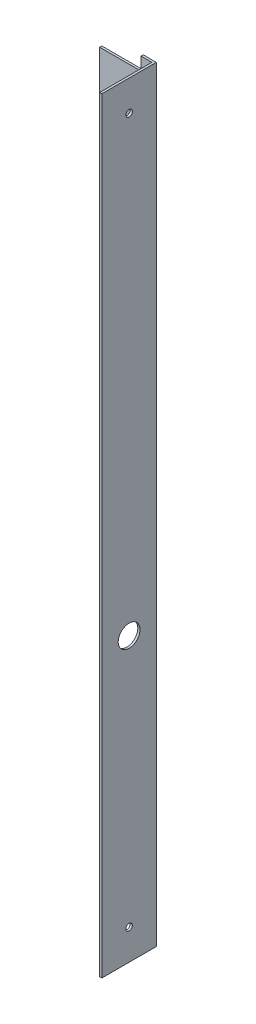
ISO-10303-21;
HEADER;
FILE_DESCRIPTION(('STEP AP214'),'2;1');
FILE_NAME('part.step','',(''),(''),'','','');
FILE_SCHEMA(('AUTOMOTIVE_DESIGN { 1 0 10303 214 1 1 1 1 }'));
ENDSEC;
DATA;
#1=APPLICATION_CONTEXT('core data for automotive mechanical design processes');
#2=APPLICATION_PROTOCOL_DEFINITION('international standard','automotive_design',2000,#1);
#3=PRODUCT_CONTEXT('',#1,'mechanical');
#4=PRODUCT('Part','Part','',(#3));
#5=PRODUCT_RELATED_PRODUCT_CATEGORY('part','',(#4));
#6=PRODUCT_DEFINITION_FORMATION('','',#4);
#7=PRODUCT_DEFINITION_CONTEXT('part definition',#1,'design');
#8=PRODUCT_DEFINITION('design','',#6,#7);
#9=PRODUCT_DEFINITION_SHAPE('','',#8);
#10=(LENGTH_UNIT() NAMED_UNIT(*) SI_UNIT(.MILLI.,.METRE.));
#11=(NAMED_UNIT(*) PLANE_ANGLE_UNIT() SI_UNIT($,.RADIAN.));
#12=(NAMED_UNIT(*) SI_UNIT($,.STERADIAN.) SOLID_ANGLE_UNIT());
#13=UNCERTAINTY_MEASURE_WITH_UNIT(LENGTH_MEASURE(1.E-05),#10,'distance_accuracy_value','');
#14=(GEOMETRIC_REPRESENTATION_CONTEXT(3) GLOBAL_UNCERTAINTY_ASSIGNED_CONTEXT((#13)) GLOBAL_UNIT_ASSIGNED_CONTEXT((#10,
#11,#12)) REPRESENTATION_CONTEXT('',''));
#15=CARTESIAN_POINT('',(0.,0.,0.));
#16=DIRECTION('',(0.,0.,1.));
#17=DIRECTION('',(1.,0.,0.));
#18=AXIS2_PLACEMENT_3D('',#15,#16,#17);
#19=CARTESIAN_POINT('',(-56.3400048408916,62.1803752262785,25.));
#20=DIRECTION('',(1.,0.,0.));
#21=DIRECTION('',(0.,1.,0.));
#22=AXIS2_PLACEMENT_3D('',#19,#20,#21);
#23=PLANE('',#22);
#24=CARTESIAN_POINT('',(-56.3400048408916,48.1803752262785,12.5));
#25=DIRECTION('',(1.,0.,0.));
#26=DIRECTION('',(0.,1.,0.));
#27=AXIS2_PLACEMENT_3D('',#24,#25,#26);
#28=CIRCLE('',#27,1.5);
#29=CARTESIAN_POINT('',(-56.3400048408916,49.6803752262785,12.5));
#30=VERTEX_POINT('',#29);
#31=EDGE_CURVE('E188',#30,#30,#28,.T.);
#32=ORIENTED_EDGE('',*,*,#31,.T.);
#33=EDGE_LOOP('',(#32));
#34=FACE_BOUND('',#33,.T.);
#35=CARTESIAN_POINT('',(-56.3400048408916,-275.819624773722,12.5));
#36=DIRECTION('',(1.,0.,0.));
#37=DIRECTION('',(0.,1.,0.));
#38=AXIS2_PLACEMENT_3D('',#35,#36,#37);
#39=CIRCLE('',#38,1.5);
#40=CARTESIAN_POINT('',(-56.3400048408916,-274.319624773722,12.5));
#41=VERTEX_POINT('',#40);
#42=EDGE_CURVE('E182',#41,#41,#39,.T.);
#43=ORIENTED_EDGE('',*,*,#42,.T.);
#44=EDGE_LOOP('',(#43));
#45=FACE_BOUND('',#44,.T.);
#46=CARTESIAN_POINT('',(-56.3400048408916,-159.819624773722,12.5));
#47=DIRECTION('',(1.,0.,0.));
#48=DIRECTION('',(0.,1.,0.));
#49=AXIS2_PLACEMENT_3D('',#46,#47,#48);
#50=CIRCLE('',#49,5.00000000000001);
#51=CARTESIAN_POINT('',(-56.3400048408916,-154.819624773722,12.5));
#52=VERTEX_POINT('',#51);
#53=EDGE_CURVE('E173',#52,#52,#50,.T.);
#54=ORIENTED_EDGE('',*,*,#53,.T.);
#55=EDGE_LOOP('',(#54));
#56=FACE_BOUND('',#55,.T.);
#57=DIRECTION('',(0.,1.,0.));
#58=VECTOR('',#57,1.);
#59=CARTESIAN_POINT('',(-56.3400048408916,-289.819624773722,1.));
#60=LINE('',#59,#58);
#61=CARTESIAN_POINT('',(-56.3400048408916,-289.819624773722,1.));
#62=VERTEX_POINT('',#61);
#63=CARTESIAN_POINT('',(-56.3400048408916,62.1803752262785,1.));
#64=VERTEX_POINT('',#63);
#65=EDGE_CURVE('E49',#62,#64,#60,.T.);
#66=ORIENTED_EDGE('',*,*,#65,.F.);
#67=DIRECTION('',(0.,0.,-1.));
#68=VECTOR('',#67,1.);
#69=CARTESIAN_POINT('',(-56.3400048408916,-289.819624773722,25.));
#70=LINE('',#69,#68);
#71=CARTESIAN_POINT('',(-56.3400048408916,-289.819624773722,25.));
#72=VERTEX_POINT('',#71);
#73=EDGE_CURVE('E11',#72,#62,#70,.T.);
#74=ORIENTED_EDGE('',*,*,#73,.F.);
#75=DIRECTION('',(0.,-1.,0.));
#76=VECTOR('',#75,1.);
#77=CARTESIAN_POINT('',(-56.3400048408916,62.1803752262785,25.));
#78=LINE('',#77,#76);
#79=CARTESIAN_POINT('',(-56.3400048408916,62.1803752262785,25.));
#80=VERTEX_POINT('',#79);
#81=EDGE_CURVE('E194',#80,#72,#78,.T.);
#82=ORIENTED_EDGE('',*,*,#81,.F.);
#83=DIRECTION('',(0.,0.,-1.));
#84=VECTOR('',#83,1.);
#85=CARTESIAN_POINT('',(-56.3400048408916,62.1803752262785,25.));
#86=LINE('',#85,#84);
#87=EDGE_CURVE('E201',#80,#64,#86,.T.);
#88=ORIENTED_EDGE('',*,*,#87,.T.);
#89=EDGE_LOOP('',(#66,#74,#82,#88));
#90=FACE_BOUND('',#89,.T.);
#91=ADVANCED_FACE('F33',(#34,#45,#56,#90),#23,.F.);
#92=CARTESIAN_POINT('',(-56.3400048408916,-289.819624773722,25.));
#93=DIRECTION('',(0.,1.,0.));
#94=DIRECTION('',(0.,0.,1.));
#95=AXIS2_PLACEMENT_3D('',#92,#93,#94);
#96=PLANE('',#95);
#97=DIRECTION('',(1.,0.,0.));
#98=VECTOR('',#97,1.);
#99=CARTESIAN_POINT('',(-56.3400048408916,-289.819624773722,0.));
#100=LINE('',#99,#98);
#101=CARTESIAN_POINT('',(-61.3400048408916,-289.819624773722,0.));
#102=VERTEX_POINT('',#101);
#103=CARTESIAN_POINT('',(-55.3400048408916,-289.819624773722,0.));
#104=VERTEX_POINT('',#103);
#105=EDGE_CURVE('E191',#102,#104,#100,.T.);
#106=ORIENTED_EDGE('',*,*,#105,.T.);
#107=DIRECTION('',(0.,0.,-1.));
#108=VECTOR('',#107,1.);
#109=CARTESIAN_POINT('',(-55.3400048408916,-289.819624773722,25.));
#110=LINE('',#109,#108);
#111=CARTESIAN_POINT('',(-55.3400048408916,-289.819624773722,25.));
#112=VERTEX_POINT('',#111);
#113=EDGE_CURVE('E41',#112,#104,#110,.T.);
#114=ORIENTED_EDGE('',*,*,#113,.F.);
#115=DIRECTION('',(1.,0.,0.));
#116=VECTOR('',#115,1.);
#117=CARTESIAN_POINT('',(-56.3400048408916,-289.819624773722,25.));
#118=LINE('',#117,#116);
#119=EDGE_CURVE('E80',#72,#112,#118,.T.);
#120=ORIENTED_EDGE('',*,*,#119,.F.);
#121=ORIENTED_EDGE('',*,*,#73,.T.);
#122=DIRECTION('',(1.,0.,0.));
#123=VECTOR('',#122,1.);
#124=CARTESIAN_POINT('',(-61.3400048408916,-289.819624773722,1.));
#125=LINE('',#124,#123);
#126=CARTESIAN_POINT('',(-61.3400048408916,-289.819624773722,1.));
#127=VERTEX_POINT('',#126);
#128=EDGE_CURVE('E214',#127,#62,#125,.T.);
#129=ORIENTED_EDGE('',*,*,#128,.F.);
#130=DIRECTION('',(0.,0.,-1.));
#131=VECTOR('',#130,1.);
#132=CARTESIAN_POINT('',(-61.3400048408916,-289.819624773722,1.));
#133=LINE('',#132,#131);
#134=EDGE_CURVE('E240',#127,#102,#133,.T.);
#135=ORIENTED_EDGE('',*,*,#134,.T.);
#136=EDGE_LOOP('',(#106,#114,#120,#121,#129,#135));
#137=FACE_BOUND('',#136,.T.);
#138=ADVANCED_FACE('F296',(#137),#96,.F.);
#139=CARTESIAN_POINT('',(-55.3400048408916,62.1803752262785,25.));
#140=DIRECTION('',(-1.,0.,0.));
#141=DIRECTION('',(0.,-1.,0.));
#142=AXIS2_PLACEMENT_3D('',#139,#140,#141);
#143=PLANE('',#142);
#144=CARTESIAN_POINT('',(-55.3400048408916,-159.819624773722,12.5));
#145=DIRECTION('',(1.,0.,0.));
#146=DIRECTION('',(0.,1.,0.));
#147=AXIS2_PLACEMENT_3D('',#144,#145,#146);
#148=CIRCLE('',#147,5.00000000000001);
#149=CARTESIAN_POINT('',(-55.3400048408916,-154.819624773722,12.5));
#150=VERTEX_POINT('',#149);
#151=EDGE_CURVE('E170',#150,#150,#148,.T.);
#152=ORIENTED_EDGE('',*,*,#151,.F.);
#153=EDGE_LOOP('',(#152));
#154=FACE_BOUND('',#153,.T.);
#155=CARTESIAN_POINT('',(-55.3400048408916,-275.819624773722,12.5));
#156=DIRECTION('',(1.,0.,0.));
#157=DIRECTION('',(0.,1.,0.));
#158=AXIS2_PLACEMENT_3D('',#155,#156,#157);
#159=CIRCLE('',#158,1.5);
#160=CARTESIAN_POINT('',(-55.3400048408916,-274.319624773722,12.5));
#161=VERTEX_POINT('',#160);
#162=EDGE_CURVE('E180',#161,#161,#159,.T.);
#163=ORIENTED_EDGE('',*,*,#162,.F.);
#164=EDGE_LOOP('',(#163));
#165=FACE_BOUND('',#164,.T.);
#166=CARTESIAN_POINT('',(-55.3400048408916,48.1803752262785,12.5));
#167=DIRECTION('',(1.,0.,0.));
#168=DIRECTION('',(0.,1.,0.));
#169=AXIS2_PLACEMENT_3D('',#166,#167,#168);
#170=CIRCLE('',#169,1.5);
#171=CARTESIAN_POINT('',(-55.3400048408916,49.6803752262785,12.5));
#172=VERTEX_POINT('',#171);
#173=EDGE_CURVE('E185',#172,#172,#170,.T.);
#174=ORIENTED_EDGE('',*,*,#173,.F.);
#175=EDGE_LOOP('',(#174));
#176=FACE_BOUND('',#175,.T.);
#177=DIRECTION('',(0.,1.,0.));
#178=VECTOR('',#177,1.);
#179=CARTESIAN_POINT('',(-55.3400048408916,62.1803752262785,0.));
#180=LINE('',#179,#178);
#181=CARTESIAN_POINT('',(-55.3400048408916,62.1803752262785,0.));
#182=VERTEX_POINT('',#181);
#183=EDGE_CURVE('E73',#104,#182,#180,.T.);
#184=ORIENTED_EDGE('',*,*,#183,.T.);
#185=DIRECTION('',(0.,0.,-1.));
#186=VECTOR('',#185,1.);
#187=CARTESIAN_POINT('',(-55.3400048408916,62.1803752262785,25.));
#188=LINE('',#187,#186);
#189=CARTESIAN_POINT('',(-55.3400048408916,62.1803752262785,25.));
#190=VERTEX_POINT('',#189);
#191=EDGE_CURVE('E207',#190,#182,#188,.T.);
#192=ORIENTED_EDGE('',*,*,#191,.F.);
#193=DIRECTION('',(0.,1.,0.));
#194=VECTOR('',#193,1.);
#195=CARTESIAN_POINT('',(-55.3400048408916,62.1803752262785,25.));
#196=LINE('',#195,#194);
#197=EDGE_CURVE('E198',#112,#190,#196,.T.);
#198=ORIENTED_EDGE('',*,*,#197,.F.);
#199=ORIENTED_EDGE('',*,*,#113,.T.);
#200=EDGE_LOOP('',(#184,#192,#198,#199));
#201=FACE_BOUND('',#200,.T.);
#202=ADVANCED_FACE('F300',(#154,#165,#176,#201),#143,.F.);
#203=CARTESIAN_POINT('',(-56.3400048408916,62.1803752262785,25.));
#204=DIRECTION('',(0.,-1.,0.));
#205=DIRECTION('',(0.,0.,-1.));
#206=AXIS2_PLACEMENT_3D('',#203,#204,#205);
#207=PLANE('',#206);
#208=DIRECTION('',(-1.,0.,0.));
#209=VECTOR('',#208,1.);
#210=CARTESIAN_POINT('',(-56.3400048408916,62.1803752262785,0.));
#211=LINE('',#210,#209);
#212=CARTESIAN_POINT('',(-61.3400048408916,62.1803752262785,0.));
#213=VERTEX_POINT('',#212);
#214=EDGE_CURVE('E196',#182,#213,#211,.T.);
#215=ORIENTED_EDGE('',*,*,#214,.T.);
#216=DIRECTION('',(0.,0.,-1.));
#217=VECTOR('',#216,1.);
#218=CARTESIAN_POINT('',(-61.3400048408916,62.1803752262785,1.));
#219=LINE('',#218,#217);
#220=CARTESIAN_POINT('',(-61.3400048408916,62.1803752262785,1.));
#221=VERTEX_POINT('',#220);
#222=EDGE_CURVE('E238',#221,#213,#219,.T.);
#223=ORIENTED_EDGE('',*,*,#222,.F.);
#224=DIRECTION('',(-1.,0.,0.));
#225=VECTOR('',#224,1.);
#226=CARTESIAN_POINT('',(-56.3400048408916,62.1803752262785,1.));
#227=LINE('',#226,#225);
#228=EDGE_CURVE('E161',#64,#221,#227,.T.);
#229=ORIENTED_EDGE('',*,*,#228,.F.);
#230=ORIENTED_EDGE('',*,*,#87,.F.);
#231=DIRECTION('',(-1.,0.,0.));
#232=VECTOR('',#231,1.);
#233=CARTESIAN_POINT('',(-56.3400048408916,62.1803752262785,25.));
#234=LINE('',#233,#232);
#235=EDGE_CURVE('E57',#190,#80,#234,.T.);
#236=ORIENTED_EDGE('',*,*,#235,.F.);
#237=ORIENTED_EDGE('',*,*,#191,.T.);
#238=EDGE_LOOP('',(#215,#223,#229,#230,#236,#237));
#239=FACE_BOUND('',#238,.T.);
#240=ADVANCED_FACE('F303',(#239),#207,.F.);
#241=CARTESIAN_POINT('',(0.,0.,25.));
#242=DIRECTION('',(0.,0.,1.));
#243=DIRECTION('',(1.,0.,0.));
#244=AXIS2_PLACEMENT_3D('',#241,#242,#243);
#245=PLANE('',#244);
#246=ORIENTED_EDGE('',*,*,#81,.T.);
#247=ORIENTED_EDGE('',*,*,#119,.T.);
#248=ORIENTED_EDGE('',*,*,#197,.T.);
#249=ORIENTED_EDGE('',*,*,#235,.T.);
#250=EDGE_LOOP('',(#246,#247,#248,#249));
#251=FACE_BOUND('',#250,.T.);
#252=ADVANCED_FACE('F298',(#251),#245,.T.);
#253=CARTESIAN_POINT('',(0.,0.,0.));
#254=DIRECTION('',(0.,0.,1.));
#255=DIRECTION('',(1.,0.,0.));
#256=AXIS2_PLACEMENT_3D('',#253,#254,#255);
#257=PLANE('',#256);
#258=ORIENTED_EDGE('',*,*,#105,.F.);
#259=DIRECTION('',(0.,-1.,0.));
#260=VECTOR('',#259,1.);
#261=CARTESIAN_POINT('',(-61.3400048408916,-283.819624773722,0.));
#262=LINE('',#261,#260);
#263=CARTESIAN_POINT('',(-61.3400048408916,-283.819624773722,0.));
#264=VERTEX_POINT('',#263);
#265=EDGE_CURVE('E165',#264,#102,#262,.T.);
#266=ORIENTED_EDGE('',*,*,#265,.F.);
#267=DIRECTION('',(1.,0.,0.));
#268=VECTOR('',#267,1.);
#269=CARTESIAN_POINT('',(-80.3400048408922,-283.819624773722,0.));
#270=LINE('',#269,#268);
#271=CARTESIAN_POINT('',(-80.3400048408922,-283.819624773722,0.));
#272=VERTEX_POINT('',#271);
#273=EDGE_CURVE('E234',#272,#264,#270,.T.);
#274=ORIENTED_EDGE('',*,*,#273,.F.);
#275=DIRECTION('',(0.,-1.,0.));
#276=VECTOR('',#275,1.);
#277=CARTESIAN_POINT('',(-80.3400048408922,-213.819624773722,0.));
#278=LINE('',#277,#276);
#279=CARTESIAN_POINT('',(-80.3400048408922,-213.819624773722,0.));
#280=VERTEX_POINT('',#279);
#281=EDGE_CURVE('E232',#280,#272,#278,.T.);
#282=ORIENTED_EDGE('',*,*,#281,.F.);
#283=DIRECTION('',(-1.,0.,0.));
#284=VECTOR('',#283,1.);
#285=CARTESIAN_POINT('',(-61.3400048408916,-213.819624773722,0.));
#286=LINE('',#285,#284);
#287=CARTESIAN_POINT('',(-61.3400048408916,-213.819624773722,0.));
#288=VERTEX_POINT('',#287);
#289=EDGE_CURVE('E230',#288,#280,#286,.T.);
#290=ORIENTED_EDGE('',*,*,#289,.F.);
#291=DIRECTION('',(0.,-1.,0.));
#292=VECTOR('',#291,1.);
#293=CARTESIAN_POINT('',(-61.3400048408916,-13.8196247737216,0.));
#294=LINE('',#293,#292);
#295=CARTESIAN_POINT('',(-61.3400048408916,-13.8196247737216,0.));
#296=VERTEX_POINT('',#295);
#297=EDGE_CURVE('E228',#296,#288,#294,.T.);
#298=ORIENTED_EDGE('',*,*,#297,.F.);
#299=DIRECTION('',(1.,0.,0.));
#300=VECTOR('',#299,1.);
#301=CARTESIAN_POINT('',(-80.3400048408922,-13.8196247737216,0.));
#302=LINE('',#301,#300);
#303=CARTESIAN_POINT('',(-80.3400048408922,-13.8196247737216,0.));
#304=VERTEX_POINT('',#303);
#305=EDGE_CURVE('E226',#304,#296,#302,.T.);
#306=ORIENTED_EDGE('',*,*,#305,.F.);
#307=DIRECTION('',(0.,-1.,0.));
#308=VECTOR('',#307,1.);
#309=CARTESIAN_POINT('',(-80.3400048408922,56.1803752262785,0.));
#310=LINE('',#309,#308);
#311=CARTESIAN_POINT('',(-80.3400048408922,56.1803752262785,0.));
#312=VERTEX_POINT('',#311);
#313=EDGE_CURVE('E224',#312,#304,#310,.T.);
#314=ORIENTED_EDGE('',*,*,#313,.F.);
#315=DIRECTION('',(-1.,0.,0.));
#316=VECTOR('',#315,1.);
#317=CARTESIAN_POINT('',(-61.3400048408916,56.1803752262785,0.));
#318=LINE('',#317,#316);
#319=CARTESIAN_POINT('',(-61.3400048408916,56.1803752262785,0.));
#320=VERTEX_POINT('',#319);
#321=EDGE_CURVE('E222',#320,#312,#318,.T.);
#322=ORIENTED_EDGE('',*,*,#321,.F.);
#323=DIRECTION('',(0.,-1.,0.));
#324=VECTOR('',#323,1.);
#325=CARTESIAN_POINT('',(-61.3400048408916,62.1803752262785,0.));
#326=LINE('',#325,#324);
#327=EDGE_CURVE('E169',#213,#320,#326,.T.);
#328=ORIENTED_EDGE('',*,*,#327,.F.);
#329=ORIENTED_EDGE('',*,*,#214,.F.);
#330=ORIENTED_EDGE('',*,*,#183,.F.);
#331=EDGE_LOOP('',(#258,#266,#274,#282,#290,#298,#306,#314,#322,#328,#329,#330));
#332=FACE_BOUND('',#331,.T.);
#333=ADVANCED_FACE('F269',(#332),#257,.F.);
#334=CARTESIAN_POINT('',(-56.3400048408916,48.1803752262785,12.5));
#335=DIRECTION('',(1.,0.,0.));
#336=DIRECTION('',(0.,1.,0.));
#337=AXIS2_PLACEMENT_3D('',#334,#335,#336);
#338=CYLINDRICAL_SURFACE('',#337,1.5);
#339=ORIENTED_EDGE('',*,*,#31,.F.);
#340=EDGE_LOOP('',(#339));
#341=FACE_BOUND('',#340,.T.);
#342=ORIENTED_EDGE('',*,*,#173,.T.);
#343=EDGE_LOOP('',(#342));
#344=FACE_BOUND('',#343,.T.);
#345=ADVANCED_FACE('F339',(#341,#344),#338,.F.);
#346=CARTESIAN_POINT('',(-56.3400048408916,-275.819624773722,12.5));
#347=DIRECTION('',(1.,0.,0.));
#348=DIRECTION('',(0.,1.,0.));
#349=AXIS2_PLACEMENT_3D('',#346,#347,#348);
#350=CYLINDRICAL_SURFACE('',#349,1.5);
#351=ORIENTED_EDGE('',*,*,#42,.F.);
#352=EDGE_LOOP('',(#351));
#353=FACE_BOUND('',#352,.T.);
#354=ORIENTED_EDGE('',*,*,#162,.T.);
#355=EDGE_LOOP('',(#354));
#356=FACE_BOUND('',#355,.T.);
#357=ADVANCED_FACE('F328',(#353,#356),#350,.F.);
#358=CARTESIAN_POINT('',(-56.3400048408916,-159.819624773722,12.5));
#359=DIRECTION('',(1.,0.,0.));
#360=DIRECTION('',(0.,1.,0.));
#361=AXIS2_PLACEMENT_3D('',#358,#359,#360);
#362=CYLINDRICAL_SURFACE('',#361,5.00000000000001);
#363=ORIENTED_EDGE('',*,*,#53,.F.);
#364=EDGE_LOOP('',(#363));
#365=FACE_BOUND('',#364,.T.);
#366=ORIENTED_EDGE('',*,*,#151,.T.);
#367=EDGE_LOOP('',(#366));
#368=FACE_BOUND('',#367,.T.);
#369=ADVANCED_FACE('F325',(#365,#368),#362,.F.);
#370=CARTESIAN_POINT('',(-61.3400048408916,62.1803752262785,1.));
#371=DIRECTION('',(1.,0.,0.));
#372=DIRECTION('',(0.,0.,-1.));
#373=AXIS2_PLACEMENT_3D('',#370,#371,#372);
#374=PLANE('',#373);
#375=ORIENTED_EDGE('',*,*,#327,.T.);
#376=DIRECTION('',(0.,0.,-1.));
#377=VECTOR('',#376,1.);
#378=CARTESIAN_POINT('',(-61.3400048408916,56.1803752262785,1.));
#379=LINE('',#378,#377);
#380=CARTESIAN_POINT('',(-61.3400048408916,56.1803752262785,1.));
#381=VERTEX_POINT('',#380);
#382=EDGE_CURVE('E149',#381,#320,#379,.T.);
#383=ORIENTED_EDGE('',*,*,#382,.F.);
#384=DIRECTION('',(0.,-1.,0.));
#385=VECTOR('',#384,1.);
#386=CARTESIAN_POINT('',(-61.3400048408916,62.1803752262785,1.));
#387=LINE('',#386,#385);
#388=EDGE_CURVE('E156',#221,#381,#387,.T.);
#389=ORIENTED_EDGE('',*,*,#388,.F.);
#390=ORIENTED_EDGE('',*,*,#222,.T.);
#391=EDGE_LOOP('',(#375,#383,#389,#390));
#392=FACE_BOUND('',#391,.T.);
#393=ADVANCED_FACE('F167',(#392),#374,.F.);
#394=CARTESIAN_POINT('',(-61.3400048408916,56.1803752262785,1.));
#395=DIRECTION('',(0.,-1.,0.));
#396=DIRECTION('',(0.,0.,-1.));
#397=AXIS2_PLACEMENT_3D('',#394,#395,#396);
#398=PLANE('',#397);
#399=ORIENTED_EDGE('',*,*,#321,.T.);
#400=DIRECTION('',(0.,0.,-1.));
#401=VECTOR('',#400,1.);
#402=CARTESIAN_POINT('',(-80.3400048408922,56.1803752262785,1.));
#403=LINE('',#402,#401);
#404=CARTESIAN_POINT('',(-80.3400048408922,56.1803752262785,1.));
#405=VERTEX_POINT('',#404);
#406=EDGE_CURVE('E152',#405,#312,#403,.T.);
#407=ORIENTED_EDGE('',*,*,#406,.F.);
#408=DIRECTION('',(-1.,0.,0.));
#409=VECTOR('',#408,1.);
#410=CARTESIAN_POINT('',(-61.3400048408916,56.1803752262785,1.));
#411=LINE('',#410,#409);
#412=EDGE_CURVE('E145',#381,#405,#411,.T.);
#413=ORIENTED_EDGE('',*,*,#412,.F.);
#414=ORIENTED_EDGE('',*,*,#382,.T.);
#415=EDGE_LOOP('',(#399,#407,#413,#414));
#416=FACE_BOUND('',#415,.T.);
#417=ADVANCED_FACE('F147',(#416),#398,.F.);
#418=CARTESIAN_POINT('',(-80.3400048408922,56.1803752262785,1.));
#419=DIRECTION('',(1.,0.,0.));
#420=DIRECTION('',(0.,1.,0.));
#421=AXIS2_PLACEMENT_3D('',#418,#419,#420);
#422=PLANE('',#421);
#423=ORIENTED_EDGE('',*,*,#313,.T.);
#424=DIRECTION('',(0.,0.,-1.));
#425=VECTOR('',#424,1.);
#426=CARTESIAN_POINT('',(-80.3400048408922,-13.8196247737216,1.));
#427=LINE('',#426,#425);
#428=CARTESIAN_POINT('',(-80.3400048408922,-13.8196247737216,1.));
#429=VERTEX_POINT('',#428);
#430=EDGE_CURVE('E175',#429,#304,#427,.T.);
#431=ORIENTED_EDGE('',*,*,#430,.F.);
#432=DIRECTION('',(0.,-1.,0.));
#433=VECTOR('',#432,1.);
#434=CARTESIAN_POINT('',(-80.3400048408922,56.1803752262785,1.));
#435=LINE('',#434,#433);
#436=EDGE_CURVE('E155',#405,#429,#435,.T.);
#437=ORIENTED_EDGE('',*,*,#436,.F.);
#438=ORIENTED_EDGE('',*,*,#406,.T.);
#439=EDGE_LOOP('',(#423,#431,#437,#438));
#440=FACE_BOUND('',#439,.T.);
#441=ADVANCED_FACE('F304',(#440),#422,.F.);
#442=CARTESIAN_POINT('',(-80.3400048408922,-13.8196247737216,1.));
#443=DIRECTION('',(0.,1.,0.));
#444=DIRECTION('',(0.,0.,1.));
#445=AXIS2_PLACEMENT_3D('',#442,#443,#444);
#446=PLANE('',#445);
#447=ORIENTED_EDGE('',*,*,#305,.T.);
#448=DIRECTION('',(0.,0.,-1.));
#449=VECTOR('',#448,1.);
#450=CARTESIAN_POINT('',(-61.3400048408916,-13.8196247737216,1.));
#451=LINE('',#450,#449);
#452=CARTESIAN_POINT('',(-61.3400048408916,-13.8196247737216,1.));
#453=VERTEX_POINT('',#452);
#454=EDGE_CURVE('E255',#453,#296,#451,.T.);
#455=ORIENTED_EDGE('',*,*,#454,.F.);
#456=DIRECTION('',(1.,0.,0.));
#457=VECTOR('',#456,1.);
#458=CARTESIAN_POINT('',(-80.3400048408922,-13.8196247737216,1.));
#459=LINE('',#458,#457);
#460=EDGE_CURVE('E264',#429,#453,#459,.T.);
#461=ORIENTED_EDGE('',*,*,#460,.F.);
#462=ORIENTED_EDGE('',*,*,#430,.T.);
#463=EDGE_LOOP('',(#447,#455,#461,#462));
#464=FACE_BOUND('',#463,.T.);
#465=ADVANCED_FACE('F262',(#464),#446,.F.);
#466=CARTESIAN_POINT('',(-61.3400048408916,-13.8196247737216,1.));
#467=DIRECTION('',(1.,0.,0.));
#468=DIRECTION('',(0.,1.,0.));
#469=AXIS2_PLACEMENT_3D('',#466,#467,#468);
#470=PLANE('',#469);
#471=ORIENTED_EDGE('',*,*,#297,.T.);
#472=DIRECTION('',(0.,0.,-1.));
#473=VECTOR('',#472,1.);
#474=CARTESIAN_POINT('',(-61.3400048408916,-213.819624773722,1.));
#475=LINE('',#474,#473);
#476=CARTESIAN_POINT('',(-61.3400048408916,-213.819624773722,1.));
#477=VERTEX_POINT('',#476);
#478=EDGE_CURVE('E252',#477,#288,#475,.T.);
#479=ORIENTED_EDGE('',*,*,#478,.F.);
#480=DIRECTION('',(0.,-1.,0.));
#481=VECTOR('',#480,1.);
#482=CARTESIAN_POINT('',(-61.3400048408916,-13.8196247737216,1.));
#483=LINE('',#482,#481);
#484=EDGE_CURVE('E283',#453,#477,#483,.T.);
#485=ORIENTED_EDGE('',*,*,#484,.F.);
#486=ORIENTED_EDGE('',*,*,#454,.T.);
#487=EDGE_LOOP('',(#471,#479,#485,#486));
#488=FACE_BOUND('',#487,.T.);
#489=ADVANCED_FACE('F274',(#488),#470,.F.);
#490=CARTESIAN_POINT('',(-61.3400048408916,-213.819624773722,1.));
#491=DIRECTION('',(0.,-1.,0.));
#492=DIRECTION('',(1.,0.,0.));
#493=AXIS2_PLACEMENT_3D('',#490,#491,#492);
#494=PLANE('',#493);
#495=ORIENTED_EDGE('',*,*,#289,.T.);
#496=DIRECTION('',(0.,0.,-1.));
#497=VECTOR('',#496,1.);
#498=CARTESIAN_POINT('',(-80.3400048408922,-213.819624773722,1.));
#499=LINE('',#498,#497);
#500=CARTESIAN_POINT('',(-80.3400048408922,-213.819624773722,1.));
#501=VERTEX_POINT('',#500);
#502=EDGE_CURVE('E249',#501,#280,#499,.T.);
#503=ORIENTED_EDGE('',*,*,#502,.F.);
#504=DIRECTION('',(-1.,0.,0.));
#505=VECTOR('',#504,1.);
#506=CARTESIAN_POINT('',(-61.3400048408916,-213.819624773722,1.));
#507=LINE('',#506,#505);
#508=EDGE_CURVE('E280',#477,#501,#507,.T.);
#509=ORIENTED_EDGE('',*,*,#508,.F.);
#510=ORIENTED_EDGE('',*,*,#478,.T.);
#511=EDGE_LOOP('',(#495,#503,#509,#510));
#512=FACE_BOUND('',#511,.T.);
#513=ADVANCED_FACE('F278',(#512),#494,.F.);
#514=CARTESIAN_POINT('',(-80.3400048408922,-213.819624773722,1.));
#515=DIRECTION('',(1.,0.,0.));
#516=DIRECTION('',(0.,0.,-1.));
#517=AXIS2_PLACEMENT_3D('',#514,#515,#516);
#518=PLANE('',#517);
#519=ORIENTED_EDGE('',*,*,#281,.T.);
#520=DIRECTION('',(0.,0.,-1.));
#521=VECTOR('',#520,1.);
#522=CARTESIAN_POINT('',(-80.3400048408922,-283.819624773722,1.));
#523=LINE('',#522,#521);
#524=CARTESIAN_POINT('',(-80.3400048408922,-283.819624773722,1.));
#525=VERTEX_POINT('',#524);
#526=EDGE_CURVE('E246',#525,#272,#523,.T.);
#527=ORIENTED_EDGE('',*,*,#526,.F.);
#528=DIRECTION('',(0.,-1.,0.));
#529=VECTOR('',#528,1.);
#530=CARTESIAN_POINT('',(-80.3400048408922,-213.819624773722,1.));
#531=LINE('',#530,#529);
#532=EDGE_CURVE('E282',#501,#525,#531,.T.);
#533=ORIENTED_EDGE('',*,*,#532,.F.);
#534=ORIENTED_EDGE('',*,*,#502,.T.);
#535=EDGE_LOOP('',(#519,#527,#533,#534));
#536=FACE_BOUND('',#535,.T.);
#537=ADVANCED_FACE('F409',(#536),#518,.F.);
#538=CARTESIAN_POINT('',(-80.3400048408922,-283.819624773722,1.));
#539=DIRECTION('',(0.,1.,0.));
#540=DIRECTION('',(0.,0.,1.));
#541=AXIS2_PLACEMENT_3D('',#538,#539,#540);
#542=PLANE('',#541);
#543=ORIENTED_EDGE('',*,*,#273,.T.);
#544=DIRECTION('',(0.,0.,-1.));
#545=VECTOR('',#544,1.);
#546=CARTESIAN_POINT('',(-61.3400048408916,-283.819624773722,1.));
#547=LINE('',#546,#545);
#548=CARTESIAN_POINT('',(-61.3400048408916,-283.819624773722,1.));
#549=VERTEX_POINT('',#548);
#550=EDGE_CURVE('E243',#549,#264,#547,.T.);
#551=ORIENTED_EDGE('',*,*,#550,.F.);
#552=DIRECTION('',(1.,0.,0.));
#553=VECTOR('',#552,1.);
#554=CARTESIAN_POINT('',(-80.3400048408922,-283.819624773722,1.));
#555=LINE('',#554,#553);
#556=EDGE_CURVE('E285',#525,#549,#555,.T.);
#557=ORIENTED_EDGE('',*,*,#556,.F.);
#558=ORIENTED_EDGE('',*,*,#526,.T.);
#559=EDGE_LOOP('',(#543,#551,#557,#558));
#560=FACE_BOUND('',#559,.T.);
#561=ADVANCED_FACE('F418',(#560),#542,.F.);
#562=CARTESIAN_POINT('',(-61.3400048408916,-283.819624773722,1.));
#563=DIRECTION('',(1.,0.,0.));
#564=DIRECTION('',(0.,0.,-1.));
#565=AXIS2_PLACEMENT_3D('',#562,#563,#564);
#566=PLANE('',#565);
#567=ORIENTED_EDGE('',*,*,#265,.T.);
#568=ORIENTED_EDGE('',*,*,#134,.F.);
#569=DIRECTION('',(0.,-1.,0.));
#570=VECTOR('',#569,1.);
#571=CARTESIAN_POINT('',(-61.3400048408916,-283.819624773722,1.));
#572=LINE('',#571,#570);
#573=EDGE_CURVE('E219',#549,#127,#572,.T.);
#574=ORIENTED_EDGE('',*,*,#573,.F.);
#575=ORIENTED_EDGE('',*,*,#550,.T.);
#576=EDGE_LOOP('',(#567,#568,#574,#575));
#577=FACE_BOUND('',#576,.T.);
#578=ADVANCED_FACE('F428',(#577),#566,.F.);
#579=CARTESIAN_POINT('',(0.,0.,1.));
#580=DIRECTION('',(0.,0.,-1.));
#581=DIRECTION('',(-1.,0.,0.));
#582=AXIS2_PLACEMENT_3D('',#579,#580,#581);
#583=PLANE('',#582);
#584=ORIENTED_EDGE('',*,*,#388,.T.);
#585=ORIENTED_EDGE('',*,*,#412,.T.);
#586=ORIENTED_EDGE('',*,*,#436,.T.);
#587=ORIENTED_EDGE('',*,*,#460,.T.);
#588=ORIENTED_EDGE('',*,*,#484,.T.);
#589=ORIENTED_EDGE('',*,*,#508,.T.);
#590=ORIENTED_EDGE('',*,*,#532,.T.);
#591=ORIENTED_EDGE('',*,*,#556,.T.);
#592=ORIENTED_EDGE('',*,*,#573,.T.);
#593=ORIENTED_EDGE('',*,*,#128,.T.);
#594=ORIENTED_EDGE('',*,*,#65,.T.);
#595=ORIENTED_EDGE('',*,*,#228,.T.);
#596=EDGE_LOOP('',(#584,#585,#586,#587,#588,#589,#590,#591,#592,#593,#594,#595));
#597=FACE_BOUND('',#596,.T.);
#598=ADVANCED_FACE('F159',(#597),#583,.F.);
#599=CLOSED_SHELL('',(#91,#138,#202,#240,#252,#333,#345,#357,#369,#393,#417,#441,#465,#489,#513,
#537,#561,#578,#598));
#600=MANIFOLD_SOLID_BREP('B2',#599);
#601=ADVANCED_BREP_SHAPE_REPRESENTATION('',(#18,#600),#14);
#602=SHAPE_DEFINITION_REPRESENTATION(#9,#601);
ENDSEC;
END-ISO-10303-21;
